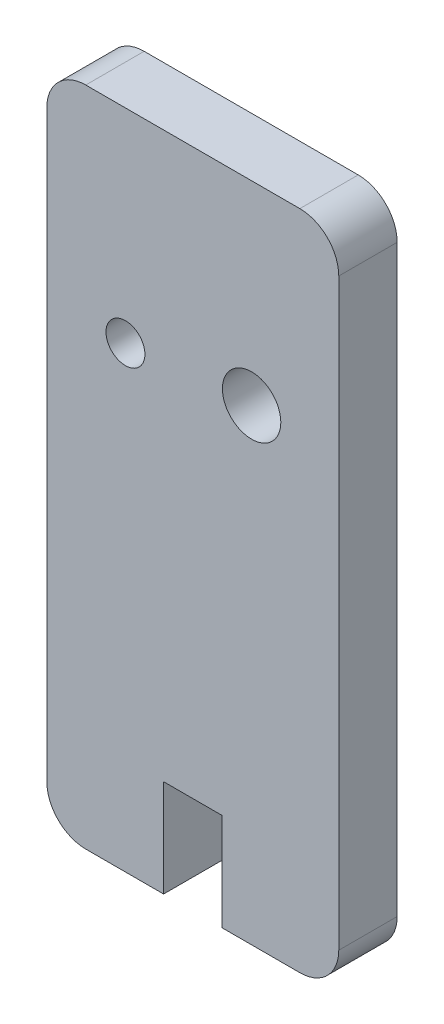
ISO-10303-21;
HEADER;
FILE_DESCRIPTION(('STEP AP214'),'2;1');
FILE_NAME('part.step','',(''),(''),'','','');
FILE_SCHEMA(('AUTOMOTIVE_DESIGN { 1 0 10303 214 1 1 1 1 }'));
ENDSEC;
DATA;
#1=APPLICATION_CONTEXT('core data for automotive mechanical design processes');
#2=APPLICATION_PROTOCOL_DEFINITION('international standard','automotive_design',2000,#1);
#3=PRODUCT_CONTEXT('',#1,'mechanical');
#4=PRODUCT('Part','Part','',(#3));
#5=PRODUCT_RELATED_PRODUCT_CATEGORY('part','',(#4));
#6=PRODUCT_DEFINITION_FORMATION('','',#4);
#7=PRODUCT_DEFINITION_CONTEXT('part definition',#1,'design');
#8=PRODUCT_DEFINITION('design','',#6,#7);
#9=PRODUCT_DEFINITION_SHAPE('','',#8);
#10=(LENGTH_UNIT() NAMED_UNIT(*) SI_UNIT(.MILLI.,.METRE.));
#11=(NAMED_UNIT(*) PLANE_ANGLE_UNIT() SI_UNIT($,.RADIAN.));
#12=(NAMED_UNIT(*) SI_UNIT($,.STERADIAN.) SOLID_ANGLE_UNIT());
#13=UNCERTAINTY_MEASURE_WITH_UNIT(LENGTH_MEASURE(1.E-05),#10,'distance_accuracy_value','');
#14=(GEOMETRIC_REPRESENTATION_CONTEXT(3) GLOBAL_UNCERTAINTY_ASSIGNED_CONTEXT((#13)) GLOBAL_UNIT_ASSIGNED_CONTEXT((#10,
#11,#12)) REPRESENTATION_CONTEXT('',''));
#15=CARTESIAN_POINT('',(0.,0.,0.));
#16=DIRECTION('',(0.,0.,1.));
#17=DIRECTION('',(1.,0.,0.));
#18=AXIS2_PLACEMENT_3D('',#15,#16,#17);
#19=CARTESIAN_POINT('',(2.00000000000001,0.,3.));
#20=DIRECTION('',(0.,1.,0.));
#21=DIRECTION('',(0.,0.,1.));
#22=AXIS2_PLACEMENT_3D('',#19,#20,#21);
#23=PLANE('',#22);
#24=DIRECTION('',(1.,0.,0.));
#25=VECTOR('',#24,1.);
#26=CARTESIAN_POINT('',(2.00000000000001,0.,0.));
#27=LINE('',#26,#25);
#28=CARTESIAN_POINT('',(2.00000000000001,0.,0.));
#29=VERTEX_POINT('',#28);
#30=CARTESIAN_POINT('',(6.,0.,0.));
#31=VERTEX_POINT('',#30);
#32=EDGE_CURVE('E166',#29,#31,#27,.T.);
#33=ORIENTED_EDGE('',*,*,#32,.T.);
#34=DIRECTION('',(0.,0.,1.));
#35=VECTOR('',#34,1.);
#36=CARTESIAN_POINT('',(6.,0.,0.));
#37=LINE('',#36,#35);
#38=CARTESIAN_POINT('',(6.,0.,3.));
#39=VERTEX_POINT('',#38);
#40=EDGE_CURVE('E213',#31,#39,#37,.T.);
#41=ORIENTED_EDGE('',*,*,#40,.T.);
#42=DIRECTION('',(1.,0.,0.));
#43=VECTOR('',#42,1.);
#44=CARTESIAN_POINT('',(2.00000000000001,0.,3.));
#45=LINE('',#44,#43);
#46=CARTESIAN_POINT('',(2.00000000000001,0.,3.));
#47=VERTEX_POINT('',#46);
#48=EDGE_CURVE('E146',#47,#39,#45,.T.);
#49=ORIENTED_EDGE('',*,*,#48,.F.);
#50=DIRECTION('',(0.,0.,-1.));
#51=VECTOR('',#50,1.);
#52=CARTESIAN_POINT('',(2.00000000000001,0.,3.));
#53=LINE('',#52,#51);
#54=EDGE_CURVE('E140',#47,#29,#53,.T.);
#55=ORIENTED_EDGE('',*,*,#54,.T.);
#56=EDGE_LOOP('',(#33,#41,#49,#55));
#57=FACE_BOUND('',#56,.T.);
#58=ADVANCED_FACE('F36',(#57),#23,.F.);
#59=CARTESIAN_POINT('',(13.,2.,3.));
#60=DIRECTION('',(0.,0.,1.));
#61=DIRECTION('',(1.,0.,0.));
#62=AXIS2_PLACEMENT_3D('',#59,#60,#61);
#63=PLANE('',#62);
#64=DIRECTION('',(0.,-1.,0.));
#65=VECTOR('',#64,1.);
#66=CARTESIAN_POINT('',(6.,0.,3.));
#67=LINE('',#66,#65);
#68=CARTESIAN_POINT('',(6.,5.,3.));
#69=VERTEX_POINT('',#68);
#70=EDGE_CURVE('E227',#69,#39,#67,.T.);
#71=ORIENTED_EDGE('',*,*,#70,.F.);
#72=DIRECTION('',(-1.,0.,0.));
#73=VECTOR('',#72,1.);
#74=CARTESIAN_POINT('',(6.,5.,3.));
#75=LINE('',#74,#73);
#76=CARTESIAN_POINT('',(9.00000000000001,5.,3.));
#77=VERTEX_POINT('',#76);
#78=EDGE_CURVE('E230',#77,#69,#75,.T.);
#79=ORIENTED_EDGE('',*,*,#78,.F.);
#80=DIRECTION('',(0.,1.,0.));
#81=VECTOR('',#80,1.);
#82=CARTESIAN_POINT('',(9.00000000000001,5.,3.));
#83=LINE('',#82,#81);
#84=CARTESIAN_POINT('',(9.00000000000001,0.,3.));
#85=VERTEX_POINT('',#84);
#86=EDGE_CURVE('E233',#85,#77,#83,.T.);
#87=ORIENTED_EDGE('',*,*,#86,.F.);
#88=CARTESIAN_POINT('',(13.,0.,3.));
#89=VERTEX_POINT('',#88);
#90=EDGE_CURVE('E60',#85,#89,#45,.T.);
#91=ORIENTED_EDGE('',*,*,#90,.T.);
#92=CARTESIAN_POINT('',(13.,2.,3.));
#93=DIRECTION('',(0.,0.,1.));
#94=DIRECTION('',(1.,0.,0.));
#95=AXIS2_PLACEMENT_3D('',#92,#93,#94);
#96=CIRCLE('',#95,2.);
#97=CARTESIAN_POINT('',(15.,2.00000000000001,3.));
#98=VERTEX_POINT('',#97);
#99=EDGE_CURVE('E169',#89,#98,#96,.T.);
#100=ORIENTED_EDGE('',*,*,#99,.T.);
#101=DIRECTION('',(0.,1.,0.));
#102=VECTOR('',#101,1.);
#103=CARTESIAN_POINT('',(15.,2.00000000000001,3.));
#104=LINE('',#103,#102);
#105=CARTESIAN_POINT('',(15.,32.,3.));
#106=VERTEX_POINT('',#105);
#107=EDGE_CURVE('E101',#98,#106,#104,.T.);
#108=ORIENTED_EDGE('',*,*,#107,.T.);
#109=CARTESIAN_POINT('',(13.,32.,3.));
#110=DIRECTION('',(0.,0.,1.));
#111=DIRECTION('',(-1.,0.,0.));
#112=AXIS2_PLACEMENT_3D('',#109,#110,#111);
#113=CIRCLE('',#112,2.);
#114=CARTESIAN_POINT('',(13.,34.,3.));
#115=VERTEX_POINT('',#114);
#116=EDGE_CURVE('E184',#106,#115,#113,.T.);
#117=ORIENTED_EDGE('',*,*,#116,.T.);
#118=DIRECTION('',(-1.,0.,0.));
#119=VECTOR('',#118,1.);
#120=CARTESIAN_POINT('',(2.,34.,3.));
#121=LINE('',#120,#119);
#122=CARTESIAN_POINT('',(2.,34.,3.));
#123=VERTEX_POINT('',#122);
#124=EDGE_CURVE('E198',#115,#123,#121,.T.);
#125=ORIENTED_EDGE('',*,*,#124,.T.);
#126=CARTESIAN_POINT('',(2.,32.,3.));
#127=DIRECTION('',(0.,0.,1.));
#128=DIRECTION('',(-1.,0.,0.));
#129=AXIS2_PLACEMENT_3D('',#126,#127,#128);
#130=CIRCLE('',#129,2.);
#131=CARTESIAN_POINT('',(0.,32.,3.));
#132=VERTEX_POINT('',#131);
#133=EDGE_CURVE('E127',#123,#132,#130,.T.);
#134=ORIENTED_EDGE('',*,*,#133,.T.);
#135=DIRECTION('',(0.,-1.,0.));
#136=VECTOR('',#135,1.);
#137=CARTESIAN_POINT('',(0.,2.00000000000001,3.));
#138=LINE('',#137,#136);
#139=CARTESIAN_POINT('',(0.,2.,3.));
#140=VERTEX_POINT('',#139);
#141=EDGE_CURVE('E117',#132,#140,#138,.T.);
#142=ORIENTED_EDGE('',*,*,#141,.T.);
#143=CARTESIAN_POINT('',(2.,2.,3.));
#144=DIRECTION('',(0.,0.,1.));
#145=DIRECTION('',(-1.,0.,0.));
#146=AXIS2_PLACEMENT_3D('',#143,#144,#145);
#147=CIRCLE('',#146,2.);
#148=EDGE_CURVE('E124',#140,#47,#147,.T.);
#149=ORIENTED_EDGE('',*,*,#148,.T.);
#150=ORIENTED_EDGE('',*,*,#48,.T.);
#151=EDGE_LOOP('',(#71,#79,#87,#91,#100,#108,#117,#125,#134,#142,#149,#150));
#152=FACE_BOUND('',#151,.T.);
#153=CARTESIAN_POINT('',(4.03845242357893,23.5330035188485,3.));
#154=DIRECTION('',(0.,0.,1.));
#155=DIRECTION('',(1.,0.,0.));
#156=AXIS2_PLACEMENT_3D('',#153,#154,#155);
#157=CIRCLE('',#156,1.);
#158=CARTESIAN_POINT('',(5.03845242357893,23.5330035188485,3.));
#159=VERTEX_POINT('',#158);
#160=EDGE_CURVE('E155',#159,#159,#157,.T.);
#161=ORIENTED_EDGE('',*,*,#160,.F.);
#162=EDGE_LOOP('',(#161));
#163=FACE_BOUND('',#162,.T.);
#164=CARTESIAN_POINT('',(10.5216548950888,24.,3.));
#165=DIRECTION('',(0.,0.,1.));
#166=DIRECTION('',(1.,0.,0.));
#167=AXIS2_PLACEMENT_3D('',#164,#165,#166);
#168=CIRCLE('',#167,1.5);
#169=CARTESIAN_POINT('',(12.0216548950888,24.,3.));
#170=VERTEX_POINT('',#169);
#171=EDGE_CURVE('E207',#170,#170,#168,.T.);
#172=ORIENTED_EDGE('',*,*,#171,.F.);
#173=EDGE_LOOP('',(#172));
#174=FACE_BOUND('',#173,.T.);
#175=ADVANCED_FACE('F120',(#152,#163,#174),#63,.T.);
#176=CARTESIAN_POINT('',(13.,2.,0.));
#177=DIRECTION('',(0.,0.,1.));
#178=DIRECTION('',(1.,0.,0.));
#179=AXIS2_PLACEMENT_3D('',#176,#177,#178);
#180=PLANE('',#179);
#181=DIRECTION('',(-1.,0.,0.));
#182=VECTOR('',#181,1.);
#183=CARTESIAN_POINT('',(6.,5.,0.));
#184=LINE('',#183,#182);
#185=CARTESIAN_POINT('',(9.00000000000001,5.,0.));
#186=VERTEX_POINT('',#185);
#187=CARTESIAN_POINT('',(6.,5.,0.));
#188=VERTEX_POINT('',#187);
#189=EDGE_CURVE('E238',#186,#188,#184,.T.);
#190=ORIENTED_EDGE('',*,*,#189,.T.);
#191=DIRECTION('',(0.,-1.,0.));
#192=VECTOR('',#191,1.);
#193=CARTESIAN_POINT('',(6.,0.,0.));
#194=LINE('',#193,#192);
#195=EDGE_CURVE('E219',#188,#31,#194,.T.);
#196=ORIENTED_EDGE('',*,*,#195,.T.);
#197=ORIENTED_EDGE('',*,*,#32,.F.);
#198=CARTESIAN_POINT('',(2.,2.,0.));
#199=DIRECTION('',(0.,0.,1.));
#200=DIRECTION('',(-1.,0.,0.));
#201=AXIS2_PLACEMENT_3D('',#198,#199,#200);
#202=CIRCLE('',#201,2.);
#203=CARTESIAN_POINT('',(0.,2.,0.));
#204=VERTEX_POINT('',#203);
#205=EDGE_CURVE('E164',#204,#29,#202,.T.);
#206=ORIENTED_EDGE('',*,*,#205,.F.);
#207=DIRECTION('',(0.,-1.,0.));
#208=VECTOR('',#207,1.);
#209=CARTESIAN_POINT('',(0.,2.00000000000001,0.));
#210=LINE('',#209,#208);
#211=CARTESIAN_POINT('',(0.,32.,0.));
#212=VERTEX_POINT('',#211);
#213=EDGE_CURVE('E136',#212,#204,#210,.T.);
#214=ORIENTED_EDGE('',*,*,#213,.F.);
#215=CARTESIAN_POINT('',(2.,32.,0.));
#216=DIRECTION('',(0.,0.,1.));
#217=DIRECTION('',(-1.,0.,0.));
#218=AXIS2_PLACEMENT_3D('',#215,#216,#217);
#219=CIRCLE('',#218,2.);
#220=CARTESIAN_POINT('',(2.,34.,0.));
#221=VERTEX_POINT('',#220);
#222=EDGE_CURVE('E161',#221,#212,#219,.T.);
#223=ORIENTED_EDGE('',*,*,#222,.F.);
#224=DIRECTION('',(-1.,0.,0.));
#225=VECTOR('',#224,1.);
#226=CARTESIAN_POINT('',(2.,34.,0.));
#227=LINE('',#226,#225);
#228=CARTESIAN_POINT('',(13.,34.,0.));
#229=VERTEX_POINT('',#228);
#230=EDGE_CURVE('E159',#229,#221,#227,.T.);
#231=ORIENTED_EDGE('',*,*,#230,.F.);
#232=CARTESIAN_POINT('',(13.,32.,0.));
#233=DIRECTION('',(0.,0.,1.));
#234=DIRECTION('',(-1.,0.,0.));
#235=AXIS2_PLACEMENT_3D('',#232,#233,#234);
#236=CIRCLE('',#235,2.);
#237=CARTESIAN_POINT('',(15.,32.,0.));
#238=VERTEX_POINT('',#237);
#239=EDGE_CURVE('E157',#238,#229,#236,.T.);
#240=ORIENTED_EDGE('',*,*,#239,.F.);
#241=DIRECTION('',(0.,1.,0.));
#242=VECTOR('',#241,1.);
#243=CARTESIAN_POINT('',(15.,2.00000000000001,0.));
#244=LINE('',#243,#242);
#245=CARTESIAN_POINT('',(15.,2.00000000000001,0.));
#246=VERTEX_POINT('',#245);
#247=EDGE_CURVE('E154',#246,#238,#244,.T.);
#248=ORIENTED_EDGE('',*,*,#247,.F.);
#249=CARTESIAN_POINT('',(13.,2.,0.));
#250=DIRECTION('',(0.,0.,1.));
#251=DIRECTION('',(1.,0.,0.));
#252=AXIS2_PLACEMENT_3D('',#249,#250,#251);
#253=CIRCLE('',#252,2.);
#254=CARTESIAN_POINT('',(13.,0.,0.));
#255=VERTEX_POINT('',#254);
#256=EDGE_CURVE('E151',#255,#246,#253,.T.);
#257=ORIENTED_EDGE('',*,*,#256,.F.);
#258=CARTESIAN_POINT('',(9.00000000000001,0.,0.));
#259=VERTEX_POINT('',#258);
#260=EDGE_CURVE('E93',#259,#255,#27,.T.);
#261=ORIENTED_EDGE('',*,*,#260,.F.);
#262=DIRECTION('',(0.,1.,0.));
#263=VECTOR('',#262,1.);
#264=CARTESIAN_POINT('',(9.00000000000001,5.,0.));
#265=LINE('',#264,#263);
#266=EDGE_CURVE('E51',#259,#186,#265,.T.);
#267=ORIENTED_EDGE('',*,*,#266,.T.);
#268=EDGE_LOOP('',(#190,#196,#197,#206,#214,#223,#231,#240,#248,#257,#261,#267));
#269=FACE_BOUND('',#268,.T.);
#270=CARTESIAN_POINT('',(4.03845242357893,23.5330035188485,0.));
#271=DIRECTION('',(0.,0.,1.));
#272=DIRECTION('',(1.,0.,0.));
#273=AXIS2_PLACEMENT_3D('',#270,#271,#272);
#274=CIRCLE('',#273,1.);
#275=CARTESIAN_POINT('',(5.03845242357893,23.5330035188485,0.));
#276=VERTEX_POINT('',#275);
#277=EDGE_CURVE('E204',#276,#276,#274,.T.);
#278=ORIENTED_EDGE('',*,*,#277,.T.);
#279=EDGE_LOOP('',(#278));
#280=FACE_BOUND('',#279,.T.);
#281=CARTESIAN_POINT('',(10.5216548950888,24.,0.));
#282=DIRECTION('',(0.,0.,1.));
#283=DIRECTION('',(1.,0.,0.));
#284=AXIS2_PLACEMENT_3D('',#281,#282,#283);
#285=CIRCLE('',#284,1.5);
#286=CARTESIAN_POINT('',(12.0216548950888,24.,0.));
#287=VERTEX_POINT('',#286);
#288=EDGE_CURVE('E210',#287,#287,#285,.T.);
#289=ORIENTED_EDGE('',*,*,#288,.T.);
#290=EDGE_LOOP('',(#289));
#291=FACE_BOUND('',#290,.T.);
#292=ADVANCED_FACE('F188',(#269,#280,#291),#180,.F.);
#293=CARTESIAN_POINT('',(13.,2.,3.));
#294=DIRECTION('',(0.,0.,-1.));
#295=DIRECTION('',(-1.,0.,0.));
#296=AXIS2_PLACEMENT_3D('',#293,#294,#295);
#297=CYLINDRICAL_SURFACE('',#296,2.);
#298=ORIENTED_EDGE('',*,*,#256,.T.);
#299=DIRECTION('',(0.,0.,-1.));
#300=VECTOR('',#299,1.);
#301=CARTESIAN_POINT('',(15.,2.00000000000001,3.));
#302=LINE('',#301,#300);
#303=EDGE_CURVE('E11',#98,#246,#302,.T.);
#304=ORIENTED_EDGE('',*,*,#303,.F.);
#305=ORIENTED_EDGE('',*,*,#99,.F.);
#306=DIRECTION('',(0.,0.,-1.));
#307=VECTOR('',#306,1.);
#308=CARTESIAN_POINT('',(13.,0.,3.));
#309=LINE('',#308,#307);
#310=EDGE_CURVE('E150',#89,#255,#309,.T.);
#311=ORIENTED_EDGE('',*,*,#310,.T.);
#312=EDGE_LOOP('',(#298,#304,#305,#311));
#313=FACE_BOUND('',#312,.T.);
#314=ADVANCED_FACE('F38',(#313),#297,.T.);
#315=CARTESIAN_POINT('',(15.,2.00000000000001,3.));
#316=DIRECTION('',(-1.,0.,0.));
#317=DIRECTION('',(0.,0.,1.));
#318=AXIS2_PLACEMENT_3D('',#315,#316,#317);
#319=PLANE('',#318);
#320=ORIENTED_EDGE('',*,*,#247,.T.);
#321=DIRECTION('',(0.,0.,-1.));
#322=VECTOR('',#321,1.);
#323=CARTESIAN_POINT('',(15.,32.,3.));
#324=LINE('',#323,#322);
#325=EDGE_CURVE('E44',#106,#238,#324,.T.);
#326=ORIENTED_EDGE('',*,*,#325,.F.);
#327=ORIENTED_EDGE('',*,*,#107,.F.);
#328=ORIENTED_EDGE('',*,*,#303,.T.);
#329=EDGE_LOOP('',(#320,#326,#327,#328));
#330=FACE_BOUND('',#329,.T.);
#331=ADVANCED_FACE('F282',(#330),#319,.F.);
#332=CARTESIAN_POINT('',(13.,32.,3.));
#333=DIRECTION('',(0.,0.,-1.));
#334=DIRECTION('',(-1.,0.,0.));
#335=AXIS2_PLACEMENT_3D('',#332,#333,#334);
#336=CYLINDRICAL_SURFACE('',#335,2.);
#337=ORIENTED_EDGE('',*,*,#239,.T.);
#338=DIRECTION('',(0.,0.,-1.));
#339=VECTOR('',#338,1.);
#340=CARTESIAN_POINT('',(13.,34.,3.));
#341=LINE('',#340,#339);
#342=EDGE_CURVE('E176',#115,#229,#341,.T.);
#343=ORIENTED_EDGE('',*,*,#342,.F.);
#344=ORIENTED_EDGE('',*,*,#116,.F.);
#345=ORIENTED_EDGE('',*,*,#325,.T.);
#346=EDGE_LOOP('',(#337,#343,#344,#345));
#347=FACE_BOUND('',#346,.T.);
#348=ADVANCED_FACE('F182',(#347),#336,.T.);
#349=CARTESIAN_POINT('',(2.,34.,3.));
#350=DIRECTION('',(0.,-1.,0.));
#351=DIRECTION('',(0.,0.,-1.));
#352=AXIS2_PLACEMENT_3D('',#349,#350,#351);
#353=PLANE('',#352);
#354=ORIENTED_EDGE('',*,*,#230,.T.);
#355=DIRECTION('',(0.,0.,-1.));
#356=VECTOR('',#355,1.);
#357=CARTESIAN_POINT('',(2.,34.,3.));
#358=LINE('',#357,#356);
#359=EDGE_CURVE('E173',#123,#221,#358,.T.);
#360=ORIENTED_EDGE('',*,*,#359,.F.);
#361=ORIENTED_EDGE('',*,*,#124,.F.);
#362=ORIENTED_EDGE('',*,*,#342,.T.);
#363=EDGE_LOOP('',(#354,#360,#361,#362));
#364=FACE_BOUND('',#363,.T.);
#365=ADVANCED_FACE('F194',(#364),#353,.F.);
#366=CARTESIAN_POINT('',(2.,32.,3.));
#367=DIRECTION('',(0.,0.,-1.));
#368=DIRECTION('',(-1.,0.,0.));
#369=AXIS2_PLACEMENT_3D('',#366,#367,#368);
#370=CYLINDRICAL_SURFACE('',#369,2.);
#371=ORIENTED_EDGE('',*,*,#222,.T.);
#372=DIRECTION('',(0.,0.,-1.));
#373=VECTOR('',#372,1.);
#374=CARTESIAN_POINT('',(0.,32.,3.));
#375=LINE('',#374,#373);
#376=EDGE_CURVE('E139',#132,#212,#375,.T.);
#377=ORIENTED_EDGE('',*,*,#376,.F.);
#378=ORIENTED_EDGE('',*,*,#133,.F.);
#379=ORIENTED_EDGE('',*,*,#359,.T.);
#380=EDGE_LOOP('',(#371,#377,#378,#379));
#381=FACE_BOUND('',#380,.T.);
#382=ADVANCED_FACE('F197',(#381),#370,.T.);
#383=CARTESIAN_POINT('',(0.,2.00000000000001,3.));
#384=DIRECTION('',(1.,0.,0.));
#385=DIRECTION('',(0.,0.,-1.));
#386=AXIS2_PLACEMENT_3D('',#383,#384,#385);
#387=PLANE('',#386);
#388=ORIENTED_EDGE('',*,*,#213,.T.);
#389=DIRECTION('',(0.,0.,-1.));
#390=VECTOR('',#389,1.);
#391=CARTESIAN_POINT('',(0.,2.,3.));
#392=LINE('',#391,#390);
#393=EDGE_CURVE('E133',#140,#204,#392,.T.);
#394=ORIENTED_EDGE('',*,*,#393,.F.);
#395=ORIENTED_EDGE('',*,*,#141,.F.);
#396=ORIENTED_EDGE('',*,*,#376,.T.);
#397=EDGE_LOOP('',(#388,#394,#395,#396));
#398=FACE_BOUND('',#397,.T.);
#399=ADVANCED_FACE('F134',(#398),#387,.F.);
#400=CARTESIAN_POINT('',(2.,2.,3.));
#401=DIRECTION('',(0.,0.,-1.));
#402=DIRECTION('',(-1.,0.,0.));
#403=AXIS2_PLACEMENT_3D('',#400,#401,#402);
#404=CYLINDRICAL_SURFACE('',#403,2.);
#405=ORIENTED_EDGE('',*,*,#205,.T.);
#406=ORIENTED_EDGE('',*,*,#54,.F.);
#407=ORIENTED_EDGE('',*,*,#148,.F.);
#408=ORIENTED_EDGE('',*,*,#393,.T.);
#409=EDGE_LOOP('',(#405,#406,#407,#408));
#410=FACE_BOUND('',#409,.T.);
#411=ADVANCED_FACE('F142',(#410),#404,.T.);
#412=ORIENTED_EDGE('',*,*,#90,.F.);
#413=DIRECTION('',(0.,0.,1.));
#414=VECTOR('',#413,1.);
#415=CARTESIAN_POINT('',(9.00000000000001,0.,0.));
#416=LINE('',#415,#414);
#417=EDGE_CURVE('E216',#259,#85,#416,.T.);
#418=ORIENTED_EDGE('',*,*,#417,.F.);
#419=ORIENTED_EDGE('',*,*,#260,.T.);
#420=ORIENTED_EDGE('',*,*,#310,.F.);
#421=EDGE_LOOP('',(#412,#418,#419,#420));
#422=FACE_BOUND('',#421,.T.);
#423=ADVANCED_FACE('F263',(#422),#23,.F.);
#424=CARTESIAN_POINT('',(4.03845242357893,23.5330035188485,3.));
#425=DIRECTION('',(0.,0.,-1.));
#426=DIRECTION('',(-1.,0.,0.));
#427=AXIS2_PLACEMENT_3D('',#424,#425,#426);
#428=CYLINDRICAL_SURFACE('',#427,1.);
#429=ORIENTED_EDGE('',*,*,#160,.T.);
#430=EDGE_LOOP('',(#429));
#431=FACE_BOUND('',#430,.T.);
#432=ORIENTED_EDGE('',*,*,#277,.F.);
#433=EDGE_LOOP('',(#432));
#434=FACE_BOUND('',#433,.T.);
#435=ADVANCED_FACE('F271',(#431,#434),#428,.F.);
#436=CARTESIAN_POINT('',(10.5216548950888,24.,3.));
#437=DIRECTION('',(0.,0.,-1.));
#438=DIRECTION('',(-1.,0.,0.));
#439=AXIS2_PLACEMENT_3D('',#436,#437,#438);
#440=CYLINDRICAL_SURFACE('',#439,1.5);
#441=ORIENTED_EDGE('',*,*,#171,.T.);
#442=EDGE_LOOP('',(#441));
#443=FACE_BOUND('',#442,.T.);
#444=ORIENTED_EDGE('',*,*,#288,.F.);
#445=EDGE_LOOP('',(#444));
#446=FACE_BOUND('',#445,.T.);
#447=ADVANCED_FACE('F276',(#443,#446),#440,.F.);
#448=CARTESIAN_POINT('',(6.,0.,0.));
#449=DIRECTION('',(-1.,0.,0.));
#450=DIRECTION('',(0.,-1.,0.));
#451=AXIS2_PLACEMENT_3D('',#448,#449,#450);
#452=PLANE('',#451);
#453=ORIENTED_EDGE('',*,*,#70,.T.);
#454=ORIENTED_EDGE('',*,*,#40,.F.);
#455=ORIENTED_EDGE('',*,*,#195,.F.);
#456=DIRECTION('',(0.,0.,1.));
#457=VECTOR('',#456,1.);
#458=CARTESIAN_POINT('',(6.,5.,0.));
#459=LINE('',#458,#457);
#460=EDGE_CURVE('E222',#188,#69,#459,.T.);
#461=ORIENTED_EDGE('',*,*,#460,.T.);
#462=EDGE_LOOP('',(#453,#454,#455,#461));
#463=FACE_BOUND('',#462,.T.);
#464=ADVANCED_FACE('F255',(#463),#452,.F.);
#465=CARTESIAN_POINT('',(6.,5.,0.));
#466=DIRECTION('',(0.,1.,0.));
#467=DIRECTION('',(0.,0.,1.));
#468=AXIS2_PLACEMENT_3D('',#465,#466,#467);
#469=PLANE('',#468);
#470=ORIENTED_EDGE('',*,*,#78,.T.);
#471=ORIENTED_EDGE('',*,*,#460,.F.);
#472=ORIENTED_EDGE('',*,*,#189,.F.);
#473=DIRECTION('',(0.,0.,1.));
#474=VECTOR('',#473,1.);
#475=CARTESIAN_POINT('',(9.00000000000001,5.,0.));
#476=LINE('',#475,#474);
#477=EDGE_CURVE('E218',#186,#77,#476,.T.);
#478=ORIENTED_EDGE('',*,*,#477,.T.);
#479=EDGE_LOOP('',(#470,#471,#472,#478));
#480=FACE_BOUND('',#479,.T.);
#481=ADVANCED_FACE('F258',(#480),#469,.F.);
#482=CARTESIAN_POINT('',(9.00000000000001,5.,0.));
#483=DIRECTION('',(1.,0.,0.));
#484=DIRECTION('',(0.,1.,0.));
#485=AXIS2_PLACEMENT_3D('',#482,#483,#484);
#486=PLANE('',#485);
#487=ORIENTED_EDGE('',*,*,#86,.T.);
#488=ORIENTED_EDGE('',*,*,#477,.F.);
#489=ORIENTED_EDGE('',*,*,#266,.F.);
#490=ORIENTED_EDGE('',*,*,#417,.T.);
#491=EDGE_LOOP('',(#487,#488,#489,#490));
#492=FACE_BOUND('',#491,.T.);
#493=ADVANCED_FACE('F357',(#492),#486,.F.);
#494=CLOSED_SHELL('',(#58,#175,#292,#314,#331,#348,#365,#382,#399,#411,#423,#435,#447,#464,#481,#493));
#495=MANIFOLD_SOLID_BREP('B2',#494);
#496=ADVANCED_BREP_SHAPE_REPRESENTATION('',(#18,#495),#14);
#497=SHAPE_DEFINITION_REPRESENTATION(#9,#496);
ENDSEC;
END-ISO-10303-21;
